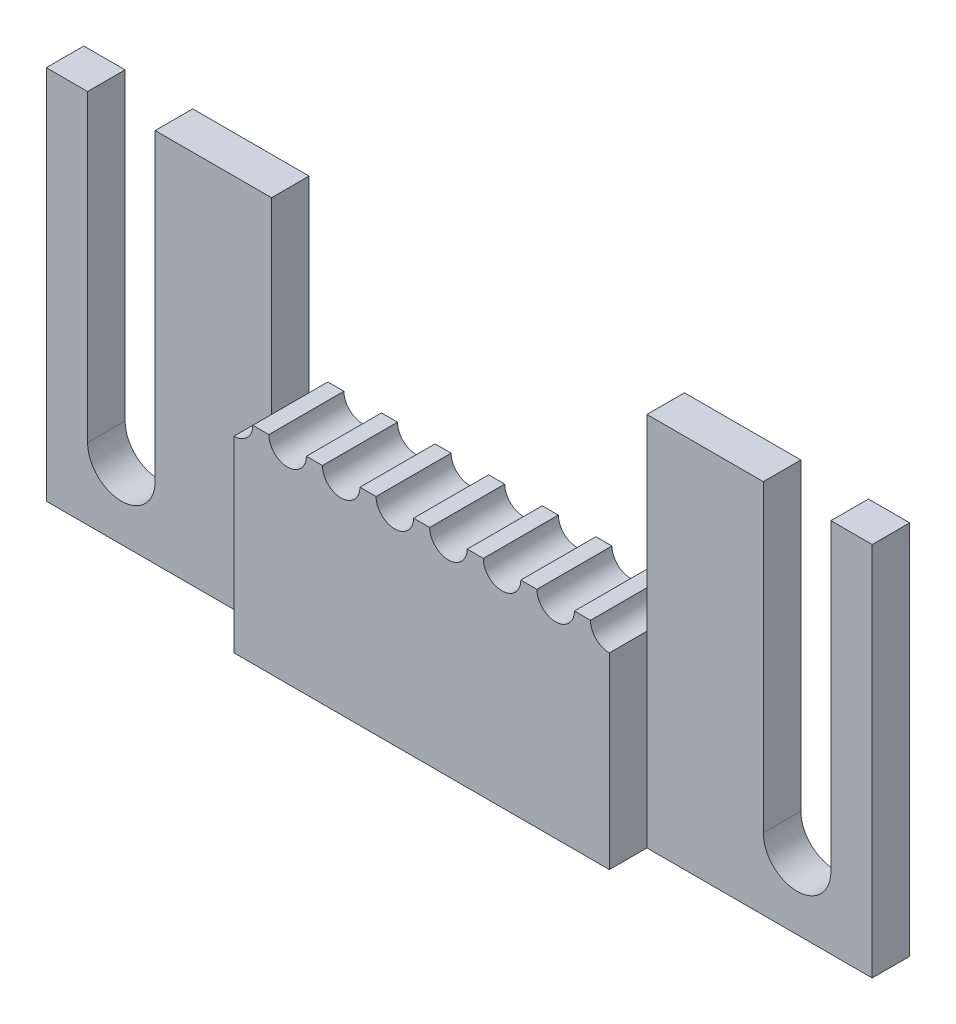
ISO-10303-21;
HEADER;
FILE_DESCRIPTION(('STEP AP214'),'2;1');
FILE_NAME('part.step','',(''),(''),'','','');
FILE_SCHEMA(('AUTOMOTIVE_DESIGN { 1 0 10303 214 1 1 1 1 }'));
ENDSEC;
DATA;
#1=APPLICATION_CONTEXT('core data for automotive mechanical design processes');
#2=APPLICATION_PROTOCOL_DEFINITION('international standard','automotive_design',2000,#1);
#3=PRODUCT_CONTEXT('',#1,'mechanical');
#4=PRODUCT('Part','Part','',(#3));
#5=PRODUCT_RELATED_PRODUCT_CATEGORY('part','',(#4));
#6=PRODUCT_DEFINITION_FORMATION('','',#4);
#7=PRODUCT_DEFINITION_CONTEXT('part definition',#1,'design');
#8=PRODUCT_DEFINITION('design','',#6,#7);
#9=PRODUCT_DEFINITION_SHAPE('','',#8);
#10=(LENGTH_UNIT() NAMED_UNIT(*) SI_UNIT(.MILLI.,.METRE.));
#11=(NAMED_UNIT(*) PLANE_ANGLE_UNIT() SI_UNIT($,.RADIAN.));
#12=(NAMED_UNIT(*) SI_UNIT($,.STERADIAN.) SOLID_ANGLE_UNIT());
#13=UNCERTAINTY_MEASURE_WITH_UNIT(LENGTH_MEASURE(1.E-05),#10,'distance_accuracy_value','');
#14=(GEOMETRIC_REPRESENTATION_CONTEXT(3) GLOBAL_UNCERTAINTY_ASSIGNED_CONTEXT((#13)) GLOBAL_UNIT_ASSIGNED_CONTEXT((#10,
#11,#12)) REPRESENTATION_CONTEXT('',''));
#15=CARTESIAN_POINT('',(0.,0.,0.));
#16=DIRECTION('',(0.,0.,1.));
#17=DIRECTION('',(1.,0.,0.));
#18=AXIS2_PLACEMENT_3D('',#15,#16,#17);
#19=CARTESIAN_POINT('',(-27.5,12.5,5.));
#20=DIRECTION('',(0.,-1.,0.));
#21=DIRECTION('',(0.,0.,-1.));
#22=AXIS2_PLACEMENT_3D('',#19,#20,#21);
#23=PLANE('',#22);
#24=DIRECTION('',(-1.,0.,0.));
#25=VECTOR('',#24,1.);
#26=CARTESIAN_POINT('',(12.5,12.5,2.5));
#27=LINE('',#26,#25);
#28=CARTESIAN_POINT('',(20.25,12.5,2.5));
#29=VERTEX_POINT('',#28);
#30=CARTESIAN_POINT('',(12.5,12.5,2.5));
#31=VERTEX_POINT('',#30);
#32=EDGE_CURVE('E621',#29,#31,#27,.T.);
#33=ORIENTED_EDGE('',*,*,#32,.F.);
#34=DIRECTION('',(0.,0.,-1.));
#35=VECTOR('',#34,1.);
#36=CARTESIAN_POINT('',(20.25,12.5,5.));
#37=LINE('',#36,#35);
#38=CARTESIAN_POINT('',(20.25,12.5,0.));
#39=VERTEX_POINT('',#38);
#40=EDGE_CURVE('E13',#29,#39,#37,.T.);
#41=ORIENTED_EDGE('',*,*,#40,.T.);
#42=DIRECTION('',(-1.,0.,0.));
#43=VECTOR('',#42,1.);
#44=CARTESIAN_POINT('',(-27.5,12.5,0.));
#45=LINE('',#44,#43);
#46=CARTESIAN_POINT('',(12.5,12.5,0.));
#47=VERTEX_POINT('',#46);
#48=EDGE_CURVE('E735',#39,#47,#45,.T.);
#49=ORIENTED_EDGE('',*,*,#48,.T.);
#50=DIRECTION('',(0.,0.,1.));
#51=VECTOR('',#50,1.);
#52=CARTESIAN_POINT('',(12.5,12.5,-5.));
#53=LINE('',#52,#51);
#54=EDGE_CURVE('E690',#47,#31,#53,.T.);
#55=ORIENTED_EDGE('',*,*,#54,.T.);
#56=EDGE_LOOP('',(#33,#41,#49,#55));
#57=FACE_BOUND('',#56,.T.);
#58=ADVANCED_FACE('F352',(#57),#23,.F.);
#59=DIRECTION('',(-1.,0.,0.));
#60=VECTOR('',#59,1.);
#61=CARTESIAN_POINT('',(-27.5,12.5,2.5));
#62=LINE('',#61,#60);
#63=CARTESIAN_POINT('',(-24.75,12.5,2.5));
#64=VERTEX_POINT('',#63);
#65=CARTESIAN_POINT('',(-27.5,12.5,2.5));
#66=VERTEX_POINT('',#65);
#67=EDGE_CURVE('E637',#64,#66,#62,.T.);
#68=ORIENTED_EDGE('',*,*,#67,.F.);
#69=DIRECTION('',(0.,0.,-1.));
#70=VECTOR('',#69,1.);
#71=CARTESIAN_POINT('',(-24.75,12.5,5.));
#72=LINE('',#71,#70);
#73=CARTESIAN_POINT('',(-24.75,12.5,0.));
#74=VERTEX_POINT('',#73);
#75=EDGE_CURVE('E803',#64,#74,#72,.T.);
#76=ORIENTED_EDGE('',*,*,#75,.T.);
#77=CARTESIAN_POINT('',(-27.5,12.5,0.));
#78=VERTEX_POINT('',#77);
#79=EDGE_CURVE('E731',#74,#78,#45,.T.);
#80=ORIENTED_EDGE('',*,*,#79,.T.);
#81=DIRECTION('',(0.,0.,-1.));
#82=VECTOR('',#81,1.);
#83=CARTESIAN_POINT('',(-27.5,12.5,5.));
#84=LINE('',#83,#82);
#85=EDGE_CURVE('E744',#66,#78,#84,.T.);
#86=ORIENTED_EDGE('',*,*,#85,.F.);
#87=EDGE_LOOP('',(#68,#76,#80,#86));
#88=FACE_BOUND('',#87,.T.);
#89=ADVANCED_FACE('F830',(#88),#23,.F.);
#90=CARTESIAN_POINT('',(27.5,12.5,0.));
#91=VERTEX_POINT('',#90);
#92=CARTESIAN_POINT('',(24.75,12.5,0.));
#93=VERTEX_POINT('',#92);
#94=EDGE_CURVE('E732',#91,#93,#45,.T.);
#95=ORIENTED_EDGE('',*,*,#94,.T.);
#96=DIRECTION('',(0.,0.,1.));
#97=VECTOR('',#96,1.);
#98=CARTESIAN_POINT('',(24.75,12.5,5.));
#99=LINE('',#98,#97);
#100=CARTESIAN_POINT('',(24.75,12.5,2.5));
#101=VERTEX_POINT('',#100);
#102=EDGE_CURVE('E360',#93,#101,#99,.T.);
#103=ORIENTED_EDGE('',*,*,#102,.T.);
#104=CARTESIAN_POINT('',(27.5,12.5,2.5));
#105=VERTEX_POINT('',#104);
#106=EDGE_CURVE('E622',#105,#101,#27,.T.);
#107=ORIENTED_EDGE('',*,*,#106,.F.);
#108=DIRECTION('',(0.,0.,-1.));
#109=VECTOR('',#108,1.);
#110=CARTESIAN_POINT('',(27.5,12.5,5.));
#111=LINE('',#110,#109);
#112=EDGE_CURVE('E747',#105,#91,#111,.T.);
#113=ORIENTED_EDGE('',*,*,#112,.T.);
#114=EDGE_LOOP('',(#95,#103,#107,#113));
#115=FACE_BOUND('',#114,.T.);
#116=ADVANCED_FACE('F807',(#115),#23,.F.);
#117=CARTESIAN_POINT('',(27.5,12.5,5.));
#118=DIRECTION('',(-1.,0.,0.));
#119=DIRECTION('',(0.,-1.,0.));
#120=AXIS2_PLACEMENT_3D('',#117,#118,#119);
#121=PLANE('',#120);
#122=DIRECTION('',(0.,1.,0.));
#123=VECTOR('',#122,1.);
#124=CARTESIAN_POINT('',(27.5,12.5,2.5));
#125=LINE('',#124,#123);
#126=CARTESIAN_POINT('',(27.5,-12.5,2.5));
#127=VERTEX_POINT('',#126);
#128=EDGE_CURVE('E619',#127,#105,#125,.T.);
#129=ORIENTED_EDGE('',*,*,#128,.F.);
#130=DIRECTION('',(0.,0.,-1.));
#131=VECTOR('',#130,1.);
#132=CARTESIAN_POINT('',(27.5,-12.5,5.));
#133=LINE('',#132,#131);
#134=CARTESIAN_POINT('',(27.5,-12.5,0.));
#135=VERTEX_POINT('',#134);
#136=EDGE_CURVE('E727',#127,#135,#133,.T.);
#137=ORIENTED_EDGE('',*,*,#136,.T.);
#138=DIRECTION('',(0.,1.,0.));
#139=VECTOR('',#138,1.);
#140=CARTESIAN_POINT('',(27.5,12.5,0.));
#141=LINE('',#140,#139);
#142=EDGE_CURVE('E676',#135,#91,#141,.T.);
#143=ORIENTED_EDGE('',*,*,#142,.T.);
#144=ORIENTED_EDGE('',*,*,#112,.F.);
#145=EDGE_LOOP('',(#129,#137,#143,#144));
#146=FACE_BOUND('',#145,.T.);
#147=ADVANCED_FACE('F354',(#146),#121,.F.);
#148=CARTESIAN_POINT('',(12.5,0.,-5.));
#149=DIRECTION('',(-1.,0.,0.));
#150=DIRECTION('',(0.,0.,1.));
#151=AXIS2_PLACEMENT_3D('',#148,#149,#150);
#152=PLANE('',#151);
#153=DIRECTION('',(0.,0.,1.));
#154=VECTOR('',#153,1.);
#155=CARTESIAN_POINT('',(12.5,4.00006400309762E-05,-5.));
#156=LINE('',#155,#154);
#157=CARTESIAN_POINT('',(12.5,4.00006400309762E-05,0.));
#158=VERTEX_POINT('',#157);
#159=CARTESIAN_POINT('',(12.5,4.00006400309762E-05,2.5));
#160=VERTEX_POINT('',#159);
#161=EDGE_CURVE('E693',#158,#160,#156,.T.);
#162=ORIENTED_EDGE('',*,*,#161,.T.);
#163=DIRECTION('',(0.,-1.,0.));
#164=VECTOR('',#163,1.);
#165=CARTESIAN_POINT('',(12.5,12.5,2.5));
#166=LINE('',#165,#164);
#167=EDGE_CURVE('E614',#31,#160,#166,.T.);
#168=ORIENTED_EDGE('',*,*,#167,.F.);
#169=ORIENTED_EDGE('',*,*,#54,.F.);
#170=DIRECTION('',(0.,-1.,0.));
#171=VECTOR('',#170,1.);
#172=CARTESIAN_POINT('',(12.5,0.,0.));
#173=LINE('',#172,#171);
#174=EDGE_CURVE('E779',#47,#158,#173,.T.);
#175=ORIENTED_EDGE('',*,*,#174,.T.);
#176=EDGE_LOOP('',(#162,#168,#169,#175));
#177=FACE_BOUND('',#176,.T.);
#178=ADVANCED_FACE('F838',(#177),#152,.T.);
#179=CARTESIAN_POINT('',(-12.5,12.5,0.));
#180=VERTEX_POINT('',#179);
#181=CARTESIAN_POINT('',(-20.25,12.5,0.));
#182=VERTEX_POINT('',#181);
#183=EDGE_CURVE('E736',#180,#182,#45,.T.);
#184=ORIENTED_EDGE('',*,*,#183,.T.);
#185=DIRECTION('',(0.,0.,1.));
#186=VECTOR('',#185,1.);
#187=CARTESIAN_POINT('',(-20.25,12.5,5.));
#188=LINE('',#187,#186);
#189=CARTESIAN_POINT('',(-20.25,12.5,2.5));
#190=VERTEX_POINT('',#189);
#191=EDGE_CURVE('E801',#182,#190,#188,.T.);
#192=ORIENTED_EDGE('',*,*,#191,.T.);
#193=CARTESIAN_POINT('',(-12.5,12.5,2.5));
#194=VERTEX_POINT('',#193);
#195=EDGE_CURVE('E638',#194,#190,#62,.T.);
#196=ORIENTED_EDGE('',*,*,#195,.F.);
#197=DIRECTION('',(0.,0.,1.));
#198=VECTOR('',#197,1.);
#199=CARTESIAN_POINT('',(-12.5,12.5,-5.));
#200=LINE('',#199,#198);
#201=EDGE_CURVE('E687',#180,#194,#200,.T.);
#202=ORIENTED_EDGE('',*,*,#201,.F.);
#203=EDGE_LOOP('',(#184,#192,#196,#202));
#204=FACE_BOUND('',#203,.T.);
#205=ADVANCED_FACE('F877',(#204),#23,.F.);
#206=CARTESIAN_POINT('',(-27.5,12.5,5.));
#207=DIRECTION('',(1.,0.,0.));
#208=DIRECTION('',(0.,0.,-1.));
#209=AXIS2_PLACEMENT_3D('',#206,#207,#208);
#210=PLANE('',#209);
#211=DIRECTION('',(0.,-1.,0.));
#212=VECTOR('',#211,1.);
#213=CARTESIAN_POINT('',(-27.5,12.5,2.5));
#214=LINE('',#213,#212);
#215=CARTESIAN_POINT('',(-27.5,-12.5,2.5));
#216=VERTEX_POINT('',#215);
#217=EDGE_CURVE('E630',#66,#216,#214,.T.);
#218=ORIENTED_EDGE('',*,*,#217,.F.);
#219=ORIENTED_EDGE('',*,*,#85,.T.);
#220=DIRECTION('',(0.,-1.,0.));
#221=VECTOR('',#220,1.);
#222=CARTESIAN_POINT('',(-27.5,12.5,0.));
#223=LINE('',#222,#221);
#224=CARTESIAN_POINT('',(-27.5,-12.5,0.));
#225=VERTEX_POINT('',#224);
#226=EDGE_CURVE('E734',#78,#225,#223,.T.);
#227=ORIENTED_EDGE('',*,*,#226,.T.);
#228=DIRECTION('',(0.,0.,-1.));
#229=VECTOR('',#228,1.);
#230=CARTESIAN_POINT('',(-27.5,-12.5,5.));
#231=LINE('',#230,#229);
#232=EDGE_CURVE('E742',#216,#225,#231,.T.);
#233=ORIENTED_EDGE('',*,*,#232,.F.);
#234=EDGE_LOOP('',(#218,#219,#227,#233));
#235=FACE_BOUND('',#234,.T.);
#236=ADVANCED_FACE('F826',(#235),#210,.F.);
#237=CARTESIAN_POINT('',(-12.5,0.,-5.));
#238=DIRECTION('',(-1.,0.,0.));
#239=DIRECTION('',(0.,0.,1.));
#240=AXIS2_PLACEMENT_3D('',#237,#238,#239);
#241=PLANE('',#240);
#242=DIRECTION('',(0.,1.,0.));
#243=VECTOR('',#242,1.);
#244=CARTESIAN_POINT('',(-12.5,0.,2.5));
#245=LINE('',#244,#243);
#246=CARTESIAN_POINT('',(-12.5,0.,2.5));
#247=VERTEX_POINT('',#246);
#248=EDGE_CURVE('E799',#247,#194,#245,.T.);
#249=ORIENTED_EDGE('',*,*,#248,.F.);
#250=DIRECTION('',(0.,0.,1.));
#251=VECTOR('',#250,1.);
#252=CARTESIAN_POINT('',(-12.5,0.,-5.));
#253=LINE('',#252,#251);
#254=CARTESIAN_POINT('',(-12.5,0.,0.));
#255=VERTEX_POINT('',#254);
#256=EDGE_CURVE('E683',#255,#247,#253,.T.);
#257=ORIENTED_EDGE('',*,*,#256,.F.);
#258=DIRECTION('',(0.,-1.,0.));
#259=VECTOR('',#258,1.);
#260=CARTESIAN_POINT('',(-12.5,0.,0.));
#261=LINE('',#260,#259);
#262=EDGE_CURVE('E796',#180,#255,#261,.T.);
#263=ORIENTED_EDGE('',*,*,#262,.F.);
#264=ORIENTED_EDGE('',*,*,#201,.T.);
#265=EDGE_LOOP('',(#249,#257,#263,#264));
#266=FACE_BOUND('',#265,.T.);
#267=ADVANCED_FACE('F888',(#266),#241,.F.);
#268=CARTESIAN_POINT('',(-27.5,-12.5,5.));
#269=DIRECTION('',(0.,1.,0.));
#270=DIRECTION('',(0.,0.,1.));
#271=AXIS2_PLACEMENT_3D('',#268,#269,#270);
#272=PLANE('',#271);
#273=DIRECTION('',(1.,0.,0.));
#274=VECTOR('',#273,1.);
#275=CARTESIAN_POINT('',(12.5,-12.5,2.5));
#276=LINE('',#275,#274);
#277=CARTESIAN_POINT('',(12.5,-12.5,2.5));
#278=VERTEX_POINT('',#277);
#279=EDGE_CURVE('E616',#278,#127,#276,.T.);
#280=ORIENTED_EDGE('',*,*,#279,.F.);
#281=DIRECTION('',(0.,0.,1.));
#282=VECTOR('',#281,1.);
#283=CARTESIAN_POINT('',(12.5,-12.5,2.5));
#284=LINE('',#283,#282);
#285=CARTESIAN_POINT('',(12.5,-12.5,5.));
#286=VERTEX_POINT('',#285);
#287=EDGE_CURVE('E625',#278,#286,#284,.T.);
#288=ORIENTED_EDGE('',*,*,#287,.T.);
#289=DIRECTION('',(1.,0.,0.));
#290=VECTOR('',#289,1.);
#291=CARTESIAN_POINT('',(-27.5,-12.5,5.));
#292=LINE('',#291,#290);
#293=CARTESIAN_POINT('',(-12.5,-12.5,5.));
#294=VERTEX_POINT('',#293);
#295=EDGE_CURVE('E724',#294,#286,#292,.T.);
#296=ORIENTED_EDGE('',*,*,#295,.F.);
#297=DIRECTION('',(0.,0.,1.));
#298=VECTOR('',#297,1.);
#299=CARTESIAN_POINT('',(-12.5,-12.5,2.5));
#300=LINE('',#299,#298);
#301=CARTESIAN_POINT('',(-12.5,-12.5,2.5));
#302=VERTEX_POINT('',#301);
#303=EDGE_CURVE('E641',#302,#294,#300,.T.);
#304=ORIENTED_EDGE('',*,*,#303,.F.);
#305=DIRECTION('',(1.,0.,0.));
#306=VECTOR('',#305,1.);
#307=CARTESIAN_POINT('',(-27.5,-12.5,2.5));
#308=LINE('',#307,#306);
#309=EDGE_CURVE('E632',#216,#302,#308,.T.);
#310=ORIENTED_EDGE('',*,*,#309,.F.);
#311=ORIENTED_EDGE('',*,*,#232,.T.);
#312=DIRECTION('',(1.,0.,0.));
#313=VECTOR('',#312,1.);
#314=CARTESIAN_POINT('',(-27.5,-12.5,0.));
#315=LINE('',#314,#313);
#316=EDGE_CURVE('E728',#225,#135,#315,.T.);
#317=ORIENTED_EDGE('',*,*,#316,.T.);
#318=ORIENTED_EDGE('',*,*,#136,.F.);
#319=EDGE_LOOP('',(#280,#288,#296,#304,#310,#311,#317,#318));
#320=FACE_BOUND('',#319,.T.);
#321=ADVANCED_FACE('F816',(#320),#272,.F.);
#322=CARTESIAN_POINT('',(0.,0.,5.));
#323=DIRECTION('',(0.,0.,1.));
#324=DIRECTION('',(1.,0.,0.));
#325=AXIS2_PLACEMENT_3D('',#322,#323,#324);
#326=PLANE('',#325);
#327=DIRECTION('',(0.,-1.,0.));
#328=VECTOR('',#327,1.);
#329=CARTESIAN_POINT('',(12.5,12.5,5.));
#330=LINE('',#329,#328);
#331=CARTESIAN_POINT('',(12.5,4.00006400309762E-05,5.));
#332=VERTEX_POINT('',#331);
#333=EDGE_CURVE('E613',#332,#286,#330,.T.);
#334=ORIENTED_EDGE('',*,*,#333,.F.);
#335=CARTESIAN_POINT('',(12.49,1.25000000000001,5.));
#336=DIRECTION('',(0.,0.,1.));
#337=DIRECTION('',(1.,0.,0.));
#338=AXIS2_PLACEMENT_3D('',#335,#336,#337);
#339=CIRCLE('',#338,1.25);
#340=CARTESIAN_POINT('',(11.24,1.25000000000001,5.));
#341=VERTEX_POINT('',#340);
#342=EDGE_CURVE('E661',#341,#332,#339,.T.);
#343=ORIENTED_EDGE('',*,*,#342,.F.);
#344=DIRECTION('',(1.,0.,0.));
#345=VECTOR('',#344,1.);
#346=CARTESIAN_POINT('',(0.,1.25000000000001,5.));
#347=LINE('',#346,#345);
#348=CARTESIAN_POINT('',(10.17,1.25000000000001,5.));
#349=VERTEX_POINT('',#348);
#350=EDGE_CURVE('E660',#349,#341,#347,.T.);
#351=ORIENTED_EDGE('',*,*,#350,.F.);
#352=CARTESIAN_POINT('',(8.92,1.25000000000001,5.));
#353=DIRECTION('',(0.,0.,1.));
#354=DIRECTION('',(1.,0.,0.));
#355=AXIS2_PLACEMENT_3D('',#352,#353,#354);
#356=CIRCLE('',#355,1.25);
#357=CARTESIAN_POINT('',(7.67,1.25000000000001,5.));
#358=VERTEX_POINT('',#357);
#359=EDGE_CURVE('E644',#358,#349,#356,.T.);
#360=ORIENTED_EDGE('',*,*,#359,.F.);
#361=CARTESIAN_POINT('',(6.6,1.25000000000001,5.));
#362=VERTEX_POINT('',#361);
#363=EDGE_CURVE('E657',#362,#358,#347,.T.);
#364=ORIENTED_EDGE('',*,*,#363,.F.);
#365=CARTESIAN_POINT('',(5.35,1.25000000000001,5.));
#366=DIRECTION('',(0.,0.,1.));
#367=DIRECTION('',(1.,0.,0.));
#368=AXIS2_PLACEMENT_3D('',#365,#366,#367);
#369=CIRCLE('',#368,1.25);
#370=CARTESIAN_POINT('',(4.1,1.25000000000001,5.));
#371=VERTEX_POINT('',#370);
#372=EDGE_CURVE('E719',#371,#362,#369,.T.);
#373=ORIENTED_EDGE('',*,*,#372,.F.);
#374=DIRECTION('',(1.,0.,0.));
#375=VECTOR('',#374,1.);
#376=CARTESIAN_POINT('',(0.,1.25000000000001,5.));
#377=LINE('',#376,#375);
#378=CARTESIAN_POINT('',(3.03,1.25000000000001,5.));
#379=VERTEX_POINT('',#378);
#380=EDGE_CURVE('E653',#379,#371,#377,.T.);
#381=ORIENTED_EDGE('',*,*,#380,.F.);
#382=CARTESIAN_POINT('',(1.78,1.25000000000001,5.));
#383=DIRECTION('',(0.,0.,1.));
#384=DIRECTION('',(1.,0.,0.));
#385=AXIS2_PLACEMENT_3D('',#382,#383,#384);
#386=CIRCLE('',#385,1.25);
#387=CARTESIAN_POINT('',(0.530000000000001,1.25000000000001,5.));
#388=VERTEX_POINT('',#387);
#389=EDGE_CURVE('E649',#388,#379,#386,.T.);
#390=ORIENTED_EDGE('',*,*,#389,.F.);
#391=CARTESIAN_POINT('',(-0.539999999999999,1.25000000000001,5.));
#392=VERTEX_POINT('',#391);
#393=EDGE_CURVE('E654',#392,#388,#377,.T.);
#394=ORIENTED_EDGE('',*,*,#393,.F.);
#395=CARTESIAN_POINT('',(-1.79,1.25000000000001,5.));
#396=DIRECTION('',(0.,0.,1.));
#397=DIRECTION('',(1.,0.,0.));
#398=AXIS2_PLACEMENT_3D('',#395,#396,#397);
#399=CIRCLE('',#398,1.25);
#400=CARTESIAN_POINT('',(-3.04,1.25000000000001,5.));
#401=VERTEX_POINT('',#400);
#402=EDGE_CURVE('E652',#401,#392,#399,.T.);
#403=ORIENTED_EDGE('',*,*,#402,.F.);
#404=CARTESIAN_POINT('',(-4.11,1.25000000000001,5.));
#405=VERTEX_POINT('',#404);
#406=EDGE_CURVE('E648',#405,#401,#377,.T.);
#407=ORIENTED_EDGE('',*,*,#406,.F.);
#408=CARTESIAN_POINT('',(-5.36,1.25000000000001,5.));
#409=DIRECTION('',(0.,0.,1.));
#410=DIRECTION('',(1.,0.,0.));
#411=AXIS2_PLACEMENT_3D('',#408,#409,#410);
#412=CIRCLE('',#411,1.25);
#413=CARTESIAN_POINT('',(-6.61,1.25000000000001,5.));
#414=VERTEX_POINT('',#413);
#415=EDGE_CURVE('E645',#414,#405,#412,.T.);
#416=ORIENTED_EDGE('',*,*,#415,.F.);
#417=DIRECTION('',(1.,0.,0.));
#418=VECTOR('',#417,1.);
#419=CARTESIAN_POINT('',(0.,1.25000000000001,5.));
#420=LINE('',#419,#418);
#421=CARTESIAN_POINT('',(-7.68,1.25000000000001,5.));
#422=VERTEX_POINT('',#421);
#423=EDGE_CURVE('E671',#422,#414,#420,.T.);
#424=ORIENTED_EDGE('',*,*,#423,.F.);
#425=CARTESIAN_POINT('',(-8.93,1.25000000000001,5.));
#426=DIRECTION('',(0.,0.,1.));
#427=DIRECTION('',(1.,0.,0.));
#428=AXIS2_PLACEMENT_3D('',#425,#426,#427);
#429=CIRCLE('',#428,1.25);
#430=CARTESIAN_POINT('',(-10.18,1.25000000000001,5.));
#431=VERTEX_POINT('',#430);
#432=EDGE_CURVE('E670',#431,#422,#429,.T.);
#433=ORIENTED_EDGE('',*,*,#432,.F.);
#434=CARTESIAN_POINT('',(-11.25,1.25000000000001,5.));
#435=VERTEX_POINT('',#434);
#436=EDGE_CURVE('E667',#435,#431,#420,.T.);
#437=ORIENTED_EDGE('',*,*,#436,.F.);
#438=CARTESIAN_POINT('',(-12.5,1.25000000000001,5.));
#439=DIRECTION('',(0.,0.,1.));
#440=DIRECTION('',(1.,0.,0.));
#441=AXIS2_PLACEMENT_3D('',#438,#439,#440);
#442=CIRCLE('',#441,1.25);
#443=CARTESIAN_POINT('',(-12.5,0.,5.));
#444=VERTEX_POINT('',#443);
#445=EDGE_CURVE('E664',#444,#435,#442,.T.);
#446=ORIENTED_EDGE('',*,*,#445,.F.);
#447=DIRECTION('',(0.,1.,0.));
#448=VECTOR('',#447,1.);
#449=CARTESIAN_POINT('',(-12.5,12.5,5.));
#450=LINE('',#449,#448);
#451=EDGE_CURVE('E629',#294,#444,#450,.T.);
#452=ORIENTED_EDGE('',*,*,#451,.F.);
#453=ORIENTED_EDGE('',*,*,#295,.T.);
#454=EDGE_LOOP('',(#334,#343,#351,#360,#364,#373,#381,#390,#394,#403,#407,#416,#424,#433,#437,
#446,#452,#453));
#455=FACE_BOUND('',#454,.T.);
#456=ADVANCED_FACE('F853',(#455),#326,.T.);
#457=CARTESIAN_POINT('',(0.,0.,0.));
#458=DIRECTION('',(0.,0.,1.));
#459=DIRECTION('',(1.,0.,0.));
#460=AXIS2_PLACEMENT_3D('',#457,#458,#459);
#461=PLANE('',#460);
#462=CARTESIAN_POINT('',(22.5,-7.75,0.));
#463=DIRECTION('',(0.,0.,1.));
#464=DIRECTION('',(1.,0.,0.));
#465=AXIS2_PLACEMENT_3D('',#462,#463,#464);
#466=CIRCLE('',#465,2.24999999999999);
#467=CARTESIAN_POINT('',(20.25,-7.75,0.));
#468=VERTEX_POINT('',#467);
#469=CARTESIAN_POINT('',(24.75,-7.75,0.));
#470=VERTEX_POINT('',#469);
#471=EDGE_CURVE('E581',#468,#470,#466,.T.);
#472=ORIENTED_EDGE('',*,*,#471,.T.);
#473=DIRECTION('',(0.,1.,0.));
#474=VECTOR('',#473,1.);
#475=CARTESIAN_POINT('',(24.75,-7.75,0.));
#476=LINE('',#475,#474);
#477=EDGE_CURVE('E567',#470,#93,#476,.T.);
#478=ORIENTED_EDGE('',*,*,#477,.T.);
#479=ORIENTED_EDGE('',*,*,#94,.F.);
#480=ORIENTED_EDGE('',*,*,#142,.F.);
#481=ORIENTED_EDGE('',*,*,#316,.F.);
#482=ORIENTED_EDGE('',*,*,#226,.F.);
#483=ORIENTED_EDGE('',*,*,#79,.F.);
#484=DIRECTION('',(0.,1.,0.));
#485=VECTOR('',#484,1.);
#486=CARTESIAN_POINT('',(-24.75,-7.75,0.));
#487=LINE('',#486,#485);
#488=CARTESIAN_POINT('',(-24.75,-7.75,0.));
#489=VERTEX_POINT('',#488);
#490=EDGE_CURVE('E598',#489,#74,#487,.T.);
#491=ORIENTED_EDGE('',*,*,#490,.F.);
#492=CARTESIAN_POINT('',(-22.5,-7.75,0.));
#493=DIRECTION('',(0.,0.,1.));
#494=DIRECTION('',(1.,0.,0.));
#495=AXIS2_PLACEMENT_3D('',#492,#493,#494);
#496=CIRCLE('',#495,2.24999999999999);
#497=CARTESIAN_POINT('',(-20.25,-7.75,0.));
#498=VERTEX_POINT('',#497);
#499=EDGE_CURVE('E608',#489,#498,#496,.T.);
#500=ORIENTED_EDGE('',*,*,#499,.T.);
#501=DIRECTION('',(0.,1.,0.));
#502=VECTOR('',#501,1.);
#503=CARTESIAN_POINT('',(-20.25,-7.75,0.));
#504=LINE('',#503,#502);
#505=EDGE_CURVE('E595',#498,#182,#504,.T.);
#506=ORIENTED_EDGE('',*,*,#505,.T.);
#507=ORIENTED_EDGE('',*,*,#183,.F.);
#508=ORIENTED_EDGE('',*,*,#262,.T.);
#509=CARTESIAN_POINT('',(-12.5,1.25000000000001,0.));
#510=DIRECTION('',(0.,0.,1.));
#511=DIRECTION('',(1.,0.,0.));
#512=AXIS2_PLACEMENT_3D('',#509,#510,#511);
#513=CIRCLE('',#512,1.25);
#514=CARTESIAN_POINT('',(-11.25,1.25000000000001,0.));
#515=VERTEX_POINT('',#514);
#516=EDGE_CURVE('E793',#255,#515,#513,.T.);
#517=ORIENTED_EDGE('',*,*,#516,.T.);
#518=DIRECTION('',(1.,0.,0.));
#519=VECTOR('',#518,1.);
#520=CARTESIAN_POINT('',(0.,1.25000000000001,0.));
#521=LINE('',#520,#519);
#522=CARTESIAN_POINT('',(-10.18,1.25000000000001,0.));
#523=VERTEX_POINT('',#522);
#524=EDGE_CURVE('E790',#515,#523,#521,.T.);
#525=ORIENTED_EDGE('',*,*,#524,.T.);
#526=CARTESIAN_POINT('',(-8.93,1.25000000000001,0.));
#527=DIRECTION('',(0.,0.,1.));
#528=DIRECTION('',(1.,0.,0.));
#529=AXIS2_PLACEMENT_3D('',#526,#527,#528);
#530=CIRCLE('',#529,1.25);
#531=CARTESIAN_POINT('',(-7.68,1.25000000000001,0.));
#532=VERTEX_POINT('',#531);
#533=EDGE_CURVE('E787',#523,#532,#530,.T.);
#534=ORIENTED_EDGE('',*,*,#533,.T.);
#535=DIRECTION('',(1.,0.,0.));
#536=VECTOR('',#535,1.);
#537=CARTESIAN_POINT('',(0.,1.25000000000001,0.));
#538=LINE('',#537,#536);
#539=CARTESIAN_POINT('',(-6.61,1.25000000000001,0.));
#540=VERTEX_POINT('',#539);
#541=EDGE_CURVE('E784',#532,#540,#538,.T.);
#542=ORIENTED_EDGE('',*,*,#541,.T.);
#543=CARTESIAN_POINT('',(-5.36,1.25000000000001,0.));
#544=DIRECTION('',(0.,0.,1.));
#545=DIRECTION('',(1.,0.,0.));
#546=AXIS2_PLACEMENT_3D('',#543,#544,#545);
#547=CIRCLE('',#546,1.25);
#548=CARTESIAN_POINT('',(-4.11,1.25000000000001,0.));
#549=VERTEX_POINT('',#548);
#550=EDGE_CURVE('E781',#540,#549,#547,.T.);
#551=ORIENTED_EDGE('',*,*,#550,.T.);
#552=DIRECTION('',(1.,0.,0.));
#553=VECTOR('',#552,1.);
#554=CARTESIAN_POINT('',(0.,1.25000000000001,0.));
#555=LINE('',#554,#553);
#556=CARTESIAN_POINT('',(-3.04,1.25000000000001,0.));
#557=VERTEX_POINT('',#556);
#558=EDGE_CURVE('E770',#549,#557,#555,.T.);
#559=ORIENTED_EDGE('',*,*,#558,.T.);
#560=CARTESIAN_POINT('',(-1.79,1.25000000000001,0.));
#561=DIRECTION('',(0.,0.,1.));
#562=DIRECTION('',(1.,0.,0.));
#563=AXIS2_PLACEMENT_3D('',#560,#561,#562);
#564=CIRCLE('',#563,1.25);
#565=CARTESIAN_POINT('',(-0.539999999999999,1.25000000000001,0.));
#566=VERTEX_POINT('',#565);
#567=EDGE_CURVE('E761',#557,#566,#564,.T.);
#568=ORIENTED_EDGE('',*,*,#567,.T.);
#569=DIRECTION('',(1.,0.,0.));
#570=VECTOR('',#569,1.);
#571=CARTESIAN_POINT('',(0.,1.25000000000001,0.));
#572=LINE('',#571,#570);
#573=CARTESIAN_POINT('',(0.530000000000001,1.25000000000001,0.));
#574=VERTEX_POINT('',#573);
#575=EDGE_CURVE('E752',#566,#574,#572,.T.);
#576=ORIENTED_EDGE('',*,*,#575,.T.);
#577=CARTESIAN_POINT('',(1.78,1.25000000000001,0.));
#578=DIRECTION('',(0.,0.,1.));
#579=DIRECTION('',(1.,0.,0.));
#580=AXIS2_PLACEMENT_3D('',#577,#578,#579);
#581=CIRCLE('',#580,1.25);
#582=CARTESIAN_POINT('',(3.03,1.25000000000001,0.));
#583=VERTEX_POINT('',#582);
#584=EDGE_CURVE('E749',#574,#583,#581,.T.);
#585=ORIENTED_EDGE('',*,*,#584,.T.);
#586=DIRECTION('',(1.,0.,0.));
#587=VECTOR('',#586,1.);
#588=CARTESIAN_POINT('',(0.,1.25000000000001,0.));
#589=LINE('',#588,#587);
#590=CARTESIAN_POINT('',(4.1,1.25000000000001,0.));
#591=VERTEX_POINT('',#590);
#592=EDGE_CURVE('E755',#583,#591,#589,.T.);
#593=ORIENTED_EDGE('',*,*,#592,.T.);
#594=CARTESIAN_POINT('',(5.35,1.25000000000001,0.));
#595=DIRECTION('',(0.,0.,1.));
#596=DIRECTION('',(1.,0.,0.));
#597=AXIS2_PLACEMENT_3D('',#594,#595,#596);
#598=CIRCLE('',#597,1.25);
#599=CARTESIAN_POINT('',(6.6,1.25000000000001,0.));
#600=VERTEX_POINT('',#599);
#601=EDGE_CURVE('E758',#591,#600,#598,.T.);
#602=ORIENTED_EDGE('',*,*,#601,.T.);
#603=DIRECTION('',(1.,0.,0.));
#604=VECTOR('',#603,1.);
#605=CARTESIAN_POINT('',(0.,1.25000000000001,0.));
#606=LINE('',#605,#604);
#607=CARTESIAN_POINT('',(7.67,1.25000000000001,0.));
#608=VERTEX_POINT('',#607);
#609=EDGE_CURVE('E764',#600,#608,#606,.T.);
#610=ORIENTED_EDGE('',*,*,#609,.T.);
#611=CARTESIAN_POINT('',(8.92,1.25000000000001,0.));
#612=DIRECTION('',(0.,0.,1.));
#613=DIRECTION('',(1.,0.,0.));
#614=AXIS2_PLACEMENT_3D('',#611,#612,#613);
#615=CIRCLE('',#614,1.25);
#616=CARTESIAN_POINT('',(10.17,1.25000000000001,0.));
#617=VERTEX_POINT('',#616);
#618=EDGE_CURVE('E767',#608,#617,#615,.T.);
#619=ORIENTED_EDGE('',*,*,#618,.T.);
#620=DIRECTION('',(1.,0.,0.));
#621=VECTOR('',#620,1.);
#622=CARTESIAN_POINT('',(0.,1.25000000000001,0.));
#623=LINE('',#622,#621);
#624=CARTESIAN_POINT('',(11.24,1.25000000000001,0.));
#625=VERTEX_POINT('',#624);
#626=EDGE_CURVE('E773',#617,#625,#623,.T.);
#627=ORIENTED_EDGE('',*,*,#626,.T.);
#628=CARTESIAN_POINT('',(12.49,1.25000000000001,0.));
#629=DIRECTION('',(0.,0.,1.));
#630=DIRECTION('',(1.,0.,0.));
#631=AXIS2_PLACEMENT_3D('',#628,#629,#630);
#632=CIRCLE('',#631,1.25);
#633=EDGE_CURVE('E776',#625,#158,#632,.T.);
#634=ORIENTED_EDGE('',*,*,#633,.T.);
#635=ORIENTED_EDGE('',*,*,#174,.F.);
#636=ORIENTED_EDGE('',*,*,#48,.F.);
#637=DIRECTION('',(0.,1.,0.));
#638=VECTOR('',#637,1.);
#639=CARTESIAN_POINT('',(20.25,-7.75,0.));
#640=LINE('',#639,#638);
#641=EDGE_CURVE('E575',#468,#39,#640,.T.);
#642=ORIENTED_EDGE('',*,*,#641,.F.);
#643=EDGE_LOOP('',(#472,#478,#479,#480,#481,#482,#483,#491,#500,#506,#507,#508,#517,#525,#534,
#542,#551,#559,#568,#576,#585,#593,#602,#610,#619,#627,#634,#635,#636,#642));
#644=FACE_BOUND('',#643,.T.);
#645=ADVANCED_FACE('F587',(#644),#461,.F.);
#646=CARTESIAN_POINT('',(0.,1.25000000000001,-5.));
#647=DIRECTION('',(0.,-1.,0.));
#648=DIRECTION('',(0.,0.,-1.));
#649=AXIS2_PLACEMENT_3D('',#646,#647,#648);
#650=PLANE('',#649);
#651=DIRECTION('',(0.,0.,1.));
#652=VECTOR('',#651,1.);
#653=CARTESIAN_POINT('',(-7.68,1.25000000000001,-5.));
#654=LINE('',#653,#652);
#655=EDGE_CURVE('E677',#532,#422,#654,.T.);
#656=ORIENTED_EDGE('',*,*,#655,.T.);
#657=ORIENTED_EDGE('',*,*,#423,.T.);
#658=DIRECTION('',(0.,0.,1.));
#659=VECTOR('',#658,1.);
#660=CARTESIAN_POINT('',(-6.61,1.25000000000001,-5.));
#661=LINE('',#660,#659);
#662=EDGE_CURVE('E674',#540,#414,#661,.T.);
#663=ORIENTED_EDGE('',*,*,#662,.F.);
#664=ORIENTED_EDGE('',*,*,#541,.F.);
#665=EDGE_LOOP('',(#656,#657,#663,#664));
#666=FACE_BOUND('',#665,.T.);
#667=ADVANCED_FACE('F1009',(#666),#650,.F.);
#668=CARTESIAN_POINT('',(-8.93,1.25000000000001,-5.));
#669=DIRECTION('',(0.,0.,1.));
#670=DIRECTION('',(1.,0.,0.));
#671=AXIS2_PLACEMENT_3D('',#668,#669,#670);
#672=CYLINDRICAL_SURFACE('',#671,1.25);
#673=DIRECTION('',(0.,0.,1.));
#674=VECTOR('',#673,1.);
#675=CARTESIAN_POINT('',(-10.18,1.25000000000001,-5.));
#676=LINE('',#675,#674);
#677=EDGE_CURVE('E679',#523,#431,#676,.T.);
#678=ORIENTED_EDGE('',*,*,#677,.T.);
#679=ORIENTED_EDGE('',*,*,#432,.T.);
#680=ORIENTED_EDGE('',*,*,#655,.F.);
#681=ORIENTED_EDGE('',*,*,#533,.F.);
#682=EDGE_LOOP('',(#678,#679,#680,#681));
#683=FACE_BOUND('',#682,.T.);
#684=ADVANCED_FACE('F1070',(#683),#672,.F.);
#685=DIRECTION('',(0.,0.,1.));
#686=VECTOR('',#685,1.);
#687=CARTESIAN_POINT('',(-11.25,1.25000000000001,-5.));
#688=LINE('',#687,#686);
#689=EDGE_CURVE('E681',#515,#435,#688,.T.);
#690=ORIENTED_EDGE('',*,*,#689,.T.);
#691=ORIENTED_EDGE('',*,*,#436,.T.);
#692=ORIENTED_EDGE('',*,*,#677,.F.);
#693=ORIENTED_EDGE('',*,*,#524,.F.);
#694=EDGE_LOOP('',(#690,#691,#692,#693));
#695=FACE_BOUND('',#694,.T.);
#696=ADVANCED_FACE('F946',(#695),#650,.F.);
#697=CARTESIAN_POINT('',(-12.5,1.25000000000001,-5.));
#698=DIRECTION('',(0.,0.,1.));
#699=DIRECTION('',(1.,0.,0.));
#700=AXIS2_PLACEMENT_3D('',#697,#698,#699);
#701=CYLINDRICAL_SURFACE('',#700,1.25);
#702=ORIENTED_EDGE('',*,*,#256,.T.);
#703=EDGE_CURVE('E686',#247,#444,#253,.T.);
#704=ORIENTED_EDGE('',*,*,#703,.T.);
#705=ORIENTED_EDGE('',*,*,#445,.T.);
#706=ORIENTED_EDGE('',*,*,#689,.F.);
#707=ORIENTED_EDGE('',*,*,#516,.F.);
#708=EDGE_LOOP('',(#702,#704,#705,#706,#707));
#709=FACE_BOUND('',#708,.T.);
#710=ADVANCED_FACE('F941',(#709),#701,.F.);
#711=CARTESIAN_POINT('',(12.49,1.25000000000001,-5.));
#712=DIRECTION('',(0.,0.,1.));
#713=DIRECTION('',(1.,0.,0.));
#714=AXIS2_PLACEMENT_3D('',#711,#712,#713);
#715=CYLINDRICAL_SURFACE('',#714,1.25);
#716=DIRECTION('',(0.,0.,1.));
#717=VECTOR('',#716,1.);
#718=CARTESIAN_POINT('',(11.24,1.25000000000001,-5.));
#719=LINE('',#718,#717);
#720=EDGE_CURVE('E697',#625,#341,#719,.T.);
#721=ORIENTED_EDGE('',*,*,#720,.T.);
#722=ORIENTED_EDGE('',*,*,#342,.T.);
#723=EDGE_CURVE('E696',#160,#332,#156,.T.);
#724=ORIENTED_EDGE('',*,*,#723,.F.);
#725=ORIENTED_EDGE('',*,*,#161,.F.);
#726=ORIENTED_EDGE('',*,*,#633,.F.);
#727=EDGE_LOOP('',(#721,#722,#724,#725,#726));
#728=FACE_BOUND('',#727,.T.);
#729=ADVANCED_FACE('F842',(#728),#715,.F.);
#730=CARTESIAN_POINT('',(0.,1.25000000000001,-5.));
#731=DIRECTION('',(0.,-1.,0.));
#732=DIRECTION('',(0.,0.,-1.));
#733=AXIS2_PLACEMENT_3D('',#730,#731,#732);
#734=PLANE('',#733);
#735=DIRECTION('',(0.,0.,1.));
#736=VECTOR('',#735,1.);
#737=CARTESIAN_POINT('',(10.17,1.25000000000001,-5.));
#738=LINE('',#737,#736);
#739=EDGE_CURVE('E699',#617,#349,#738,.T.);
#740=ORIENTED_EDGE('',*,*,#739,.T.);
#741=ORIENTED_EDGE('',*,*,#350,.T.);
#742=ORIENTED_EDGE('',*,*,#720,.F.);
#743=ORIENTED_EDGE('',*,*,#626,.F.);
#744=EDGE_LOOP('',(#740,#741,#742,#743));
#745=FACE_BOUND('',#744,.T.);
#746=ADVANCED_FACE('F846',(#745),#734,.F.);
#747=DIRECTION('',(0.,0.,1.));
#748=VECTOR('',#747,1.);
#749=CARTESIAN_POINT('',(6.6,1.25000000000001,-5.));
#750=LINE('',#749,#748);
#751=EDGE_CURVE('E703',#600,#362,#750,.T.);
#752=ORIENTED_EDGE('',*,*,#751,.T.);
#753=ORIENTED_EDGE('',*,*,#363,.T.);
#754=DIRECTION('',(0.,0.,1.));
#755=VECTOR('',#754,1.);
#756=CARTESIAN_POINT('',(7.67,1.25000000000001,-5.));
#757=LINE('',#756,#755);
#758=EDGE_CURVE('E701',#608,#358,#757,.T.);
#759=ORIENTED_EDGE('',*,*,#758,.F.);
#760=ORIENTED_EDGE('',*,*,#609,.F.);
#761=EDGE_LOOP('',(#752,#753,#759,#760));
#762=FACE_BOUND('',#761,.T.);
#763=ADVANCED_FACE('F1076',(#762),#734,.F.);
#764=CARTESIAN_POINT('',(0.,1.25000000000001,-5.));
#765=DIRECTION('',(0.,-1.,0.));
#766=DIRECTION('',(0.,0.,-1.));
#767=AXIS2_PLACEMENT_3D('',#764,#765,#766);
#768=PLANE('',#767);
#769=DIRECTION('',(0.,0.,1.));
#770=VECTOR('',#769,1.);
#771=CARTESIAN_POINT('',(3.03,1.25000000000001,-5.));
#772=LINE('',#771,#770);
#773=EDGE_CURVE('E707',#583,#379,#772,.T.);
#774=ORIENTED_EDGE('',*,*,#773,.T.);
#775=ORIENTED_EDGE('',*,*,#380,.T.);
#776=DIRECTION('',(0.,0.,1.));
#777=VECTOR('',#776,1.);
#778=CARTESIAN_POINT('',(4.1,1.25000000000001,-5.));
#779=LINE('',#778,#777);
#780=EDGE_CURVE('E705',#591,#371,#779,.T.);
#781=ORIENTED_EDGE('',*,*,#780,.F.);
#782=ORIENTED_EDGE('',*,*,#592,.F.);
#783=EDGE_LOOP('',(#774,#775,#781,#782));
#784=FACE_BOUND('',#783,.T.);
#785=ADVANCED_FACE('F1077',(#784),#768,.F.);
#786=DIRECTION('',(0.,0.,1.));
#787=VECTOR('',#786,1.);
#788=CARTESIAN_POINT('',(-0.539999999999999,1.25000000000001,-5.));
#789=LINE('',#788,#787);
#790=EDGE_CURVE('E711',#566,#392,#789,.T.);
#791=ORIENTED_EDGE('',*,*,#790,.T.);
#792=ORIENTED_EDGE('',*,*,#393,.T.);
#793=DIRECTION('',(0.,0.,1.));
#794=VECTOR('',#793,1.);
#795=CARTESIAN_POINT('',(0.530000000000001,1.25000000000001,-5.));
#796=LINE('',#795,#794);
#797=EDGE_CURVE('E709',#574,#388,#796,.T.);
#798=ORIENTED_EDGE('',*,*,#797,.F.);
#799=ORIENTED_EDGE('',*,*,#575,.F.);
#800=EDGE_LOOP('',(#791,#792,#798,#799));
#801=FACE_BOUND('',#800,.T.);
#802=ADVANCED_FACE('F1080',(#801),#768,.F.);
#803=CARTESIAN_POINT('',(-1.79,1.25000000000001,-5.));
#804=DIRECTION('',(0.,0.,1.));
#805=DIRECTION('',(1.,0.,0.));
#806=AXIS2_PLACEMENT_3D('',#803,#804,#805);
#807=CYLINDRICAL_SURFACE('',#806,1.25);
#808=DIRECTION('',(0.,0.,1.));
#809=VECTOR('',#808,1.);
#810=CARTESIAN_POINT('',(-3.04,1.25000000000001,-5.));
#811=LINE('',#810,#809);
#812=EDGE_CURVE('E713',#557,#401,#811,.T.);
#813=ORIENTED_EDGE('',*,*,#812,.T.);
#814=ORIENTED_EDGE('',*,*,#402,.T.);
#815=ORIENTED_EDGE('',*,*,#790,.F.);
#816=ORIENTED_EDGE('',*,*,#567,.F.);
#817=EDGE_LOOP('',(#813,#814,#815,#816));
#818=FACE_BOUND('',#817,.T.);
#819=ADVANCED_FACE('F1083',(#818),#807,.F.);
#820=DIRECTION('',(0.,0.,1.));
#821=VECTOR('',#820,1.);
#822=CARTESIAN_POINT('',(-4.11,1.25000000000001,-5.));
#823=LINE('',#822,#821);
#824=EDGE_CURVE('E715',#549,#405,#823,.T.);
#825=ORIENTED_EDGE('',*,*,#824,.T.);
#826=ORIENTED_EDGE('',*,*,#406,.T.);
#827=ORIENTED_EDGE('',*,*,#812,.F.);
#828=ORIENTED_EDGE('',*,*,#558,.F.);
#829=EDGE_LOOP('',(#825,#826,#827,#828));
#830=FACE_BOUND('',#829,.T.);
#831=ADVANCED_FACE('F1082',(#830),#768,.F.);
#832=CARTESIAN_POINT('',(-5.36,1.25000000000001,-5.));
#833=DIRECTION('',(0.,0.,1.));
#834=DIRECTION('',(1.,0.,0.));
#835=AXIS2_PLACEMENT_3D('',#832,#833,#834);
#836=CYLINDRICAL_SURFACE('',#835,1.25);
#837=ORIENTED_EDGE('',*,*,#662,.T.);
#838=ORIENTED_EDGE('',*,*,#415,.T.);
#839=ORIENTED_EDGE('',*,*,#824,.F.);
#840=ORIENTED_EDGE('',*,*,#550,.F.);
#841=EDGE_LOOP('',(#837,#838,#839,#840));
#842=FACE_BOUND('',#841,.T.);
#843=ADVANCED_FACE('F1087',(#842),#836,.F.);
#844=CARTESIAN_POINT('',(8.92,1.25000000000001,-5.));
#845=DIRECTION('',(0.,0.,1.));
#846=DIRECTION('',(1.,0.,0.));
#847=AXIS2_PLACEMENT_3D('',#844,#845,#846);
#848=CYLINDRICAL_SURFACE('',#847,1.25);
#849=ORIENTED_EDGE('',*,*,#758,.T.);
#850=ORIENTED_EDGE('',*,*,#359,.T.);
#851=ORIENTED_EDGE('',*,*,#739,.F.);
#852=ORIENTED_EDGE('',*,*,#618,.F.);
#853=EDGE_LOOP('',(#849,#850,#851,#852));
#854=FACE_BOUND('',#853,.T.);
#855=ADVANCED_FACE('F1090',(#854),#848,.F.);
#856=CARTESIAN_POINT('',(5.35,1.25000000000001,-5.));
#857=DIRECTION('',(0.,0.,1.));
#858=DIRECTION('',(1.,0.,0.));
#859=AXIS2_PLACEMENT_3D('',#856,#857,#858);
#860=CYLINDRICAL_SURFACE('',#859,1.25);
#861=ORIENTED_EDGE('',*,*,#780,.T.);
#862=ORIENTED_EDGE('',*,*,#372,.T.);
#863=ORIENTED_EDGE('',*,*,#751,.F.);
#864=ORIENTED_EDGE('',*,*,#601,.F.);
#865=EDGE_LOOP('',(#861,#862,#863,#864));
#866=FACE_BOUND('',#865,.T.);
#867=ADVANCED_FACE('F1093',(#866),#860,.F.);
#868=CARTESIAN_POINT('',(1.78,1.25000000000001,-5.));
#869=DIRECTION('',(0.,0.,1.));
#870=DIRECTION('',(1.,0.,0.));
#871=AXIS2_PLACEMENT_3D('',#868,#869,#870);
#872=CYLINDRICAL_SURFACE('',#871,1.25);
#873=ORIENTED_EDGE('',*,*,#797,.T.);
#874=ORIENTED_EDGE('',*,*,#389,.T.);
#875=ORIENTED_EDGE('',*,*,#773,.F.);
#876=ORIENTED_EDGE('',*,*,#584,.F.);
#877=EDGE_LOOP('',(#873,#874,#875,#876));
#878=FACE_BOUND('',#877,.T.);
#879=ADVANCED_FACE('F970',(#878),#872,.F.);
#880=CARTESIAN_POINT('',(-12.5,12.5,2.5));
#881=DIRECTION('',(1.,0.,0.));
#882=DIRECTION('',(0.,0.,-1.));
#883=AXIS2_PLACEMENT_3D('',#880,#881,#882);
#884=PLANE('',#883);
#885=DIRECTION('',(0.,1.,0.));
#886=VECTOR('',#885,1.);
#887=CARTESIAN_POINT('',(-12.5,12.5,2.5));
#888=LINE('',#887,#886);
#889=EDGE_CURVE('E635',#302,#247,#888,.T.);
#890=ORIENTED_EDGE('',*,*,#889,.F.);
#891=ORIENTED_EDGE('',*,*,#303,.T.);
#892=ORIENTED_EDGE('',*,*,#451,.T.);
#893=ORIENTED_EDGE('',*,*,#703,.F.);
#894=EDGE_LOOP('',(#890,#891,#892,#893));
#895=FACE_BOUND('',#894,.T.);
#896=ADVANCED_FACE('F964',(#895),#884,.F.);
#897=CARTESIAN_POINT('',(0.,0.,2.5));
#898=DIRECTION('',(0.,0.,1.));
#899=DIRECTION('',(1.,0.,0.));
#900=AXIS2_PLACEMENT_3D('',#897,#898,#899);
#901=PLANE('',#900);
#902=DIRECTION('',(0.,1.,0.));
#903=VECTOR('',#902,1.);
#904=CARTESIAN_POINT('',(-20.2500000000001,-7.75,2.5));
#905=LINE('',#904,#903);
#906=CARTESIAN_POINT('',(-20.25,-7.75,2.5));
#907=VERTEX_POINT('',#906);
#908=EDGE_CURVE('E375',#907,#190,#905,.T.);
#909=ORIENTED_EDGE('',*,*,#908,.F.);
#910=CARTESIAN_POINT('',(-22.5,-7.75,2.5));
#911=DIRECTION('',(0.,0.,1.));
#912=DIRECTION('',(1.,0.,0.));
#913=AXIS2_PLACEMENT_3D('',#910,#911,#912);
#914=CIRCLE('',#913,2.24999999999999);
#915=CARTESIAN_POINT('',(-24.75,-7.75,2.5));
#916=VERTEX_POINT('',#915);
#917=EDGE_CURVE('E606',#916,#907,#914,.T.);
#918=ORIENTED_EDGE('',*,*,#917,.F.);
#919=DIRECTION('',(0.,1.,0.));
#920=VECTOR('',#919,1.);
#921=CARTESIAN_POINT('',(-24.75,-7.75,2.5));
#922=LINE('',#921,#920);
#923=EDGE_CURVE('E600',#916,#64,#922,.T.);
#924=ORIENTED_EDGE('',*,*,#923,.T.);
#925=ORIENTED_EDGE('',*,*,#67,.T.);
#926=ORIENTED_EDGE('',*,*,#217,.T.);
#927=ORIENTED_EDGE('',*,*,#309,.T.);
#928=ORIENTED_EDGE('',*,*,#889,.T.);
#929=ORIENTED_EDGE('',*,*,#248,.T.);
#930=ORIENTED_EDGE('',*,*,#195,.T.);
#931=EDGE_LOOP('',(#909,#918,#924,#925,#926,#927,#928,#929,#930));
#932=FACE_BOUND('',#931,.T.);
#933=ADVANCED_FACE('F969',(#932),#901,.T.);
#934=CARTESIAN_POINT('',(12.5,12.5,2.5));
#935=DIRECTION('',(-1.,0.,0.));
#936=DIRECTION('',(0.,0.,1.));
#937=AXIS2_PLACEMENT_3D('',#934,#935,#936);
#938=PLANE('',#937);
#939=ORIENTED_EDGE('',*,*,#333,.T.);
#940=ORIENTED_EDGE('',*,*,#287,.F.);
#941=EDGE_CURVE('E617',#160,#278,#166,.T.);
#942=ORIENTED_EDGE('',*,*,#941,.F.);
#943=ORIENTED_EDGE('',*,*,#723,.T.);
#944=EDGE_LOOP('',(#939,#940,#942,#943));
#945=FACE_BOUND('',#944,.T.);
#946=ADVANCED_FACE('F856',(#945),#938,.F.);
#947=CARTESIAN_POINT('',(0.,0.,2.5));
#948=DIRECTION('',(0.,0.,1.));
#949=DIRECTION('',(1.,0.,0.));
#950=AXIS2_PLACEMENT_3D('',#947,#948,#949);
#951=PLANE('',#950);
#952=DIRECTION('',(0.,1.,0.));
#953=VECTOR('',#952,1.);
#954=CARTESIAN_POINT('',(24.75,-7.75,2.5));
#955=LINE('',#954,#953);
#956=CARTESIAN_POINT('',(24.75,-7.75,2.5));
#957=VERTEX_POINT('',#956);
#958=EDGE_CURVE('E367',#957,#101,#955,.T.);
#959=ORIENTED_EDGE('',*,*,#958,.F.);
#960=CARTESIAN_POINT('',(22.5,-7.75,2.5));
#961=DIRECTION('',(0.,0.,1.));
#962=DIRECTION('',(1.,0.,0.));
#963=AXIS2_PLACEMENT_3D('',#960,#961,#962);
#964=CIRCLE('',#963,2.24999999999999);
#965=CARTESIAN_POINT('',(20.2500000000001,-7.75,2.5));
#966=VERTEX_POINT('',#965);
#967=EDGE_CURVE('E584',#966,#957,#964,.T.);
#968=ORIENTED_EDGE('',*,*,#967,.F.);
#969=DIRECTION('',(0.,1.,0.));
#970=VECTOR('',#969,1.);
#971=CARTESIAN_POINT('',(20.25,-7.75,2.5));
#972=LINE('',#971,#970);
#973=EDGE_CURVE('E585',#966,#29,#972,.T.);
#974=ORIENTED_EDGE('',*,*,#973,.T.);
#975=ORIENTED_EDGE('',*,*,#32,.T.);
#976=ORIENTED_EDGE('',*,*,#167,.T.);
#977=ORIENTED_EDGE('',*,*,#941,.T.);
#978=ORIENTED_EDGE('',*,*,#279,.T.);
#979=ORIENTED_EDGE('',*,*,#128,.T.);
#980=ORIENTED_EDGE('',*,*,#106,.T.);
#981=EDGE_LOOP('',(#959,#968,#974,#975,#976,#977,#978,#979,#980));
#982=FACE_BOUND('',#981,.T.);
#983=ADVANCED_FACE('F810',(#982),#951,.T.);
#984=CARTESIAN_POINT('',(-24.75,-7.75,2.5));
#985=DIRECTION('',(-1.,0.,0.));
#986=DIRECTION('',(0.,0.,1.));
#987=AXIS2_PLACEMENT_3D('',#984,#985,#986);
#988=PLANE('',#987);
#989=ORIENTED_EDGE('',*,*,#923,.F.);
#990=DIRECTION('',(0.,0.,1.));
#991=VECTOR('',#990,1.);
#992=CARTESIAN_POINT('',(-24.75,-7.75,2.5));
#993=LINE('',#992,#991);
#994=EDGE_CURVE('E611',#916,#489,#993,.F.);
#995=ORIENTED_EDGE('',*,*,#994,.T.);
#996=ORIENTED_EDGE('',*,*,#490,.T.);
#997=ORIENTED_EDGE('',*,*,#75,.F.);
#998=EDGE_LOOP('',(#989,#995,#996,#997));
#999=FACE_BOUND('',#998,.T.);
#1000=ADVANCED_FACE('F1025',(#999),#988,.F.);
#1001=CARTESIAN_POINT('',(-20.25,-7.75,0.));
#1002=DIRECTION('',(1.,0.,0.));
#1003=DIRECTION('',(0.,0.,-1.));
#1004=AXIS2_PLACEMENT_3D('',#1001,#1002,#1003);
#1005=PLANE('',#1004);
#1006=ORIENTED_EDGE('',*,*,#505,.F.);
#1007=DIRECTION('',(0.,0.,-1.));
#1008=VECTOR('',#1007,1.);
#1009=CARTESIAN_POINT('',(-20.25,-7.75,0.));
#1010=LINE('',#1009,#1008);
#1011=EDGE_CURVE('E603',#907,#498,#1010,.T.);
#1012=ORIENTED_EDGE('',*,*,#1011,.F.);
#1013=ORIENTED_EDGE('',*,*,#908,.T.);
#1014=ORIENTED_EDGE('',*,*,#191,.F.);
#1015=EDGE_LOOP('',(#1006,#1012,#1013,#1014));
#1016=FACE_BOUND('',#1015,.T.);
#1017=ADVANCED_FACE('F872',(#1016),#1005,.F.);
#1018=CARTESIAN_POINT('',(-22.5,-7.75,2.5));
#1019=DIRECTION('',(0.,0.,1.));
#1020=DIRECTION('',(1.,0.,0.));
#1021=AXIS2_PLACEMENT_3D('',#1018,#1019,#1020);
#1022=CYLINDRICAL_SURFACE('',#1021,2.24999999999999);
#1023=ORIENTED_EDGE('',*,*,#917,.T.);
#1024=ORIENTED_EDGE('',*,*,#1011,.T.);
#1025=ORIENTED_EDGE('',*,*,#499,.F.);
#1026=ORIENTED_EDGE('',*,*,#994,.F.);
#1027=EDGE_LOOP('',(#1023,#1024,#1025,#1026));
#1028=FACE_BOUND('',#1027,.T.);
#1029=ADVANCED_FACE('F865',(#1028),#1022,.F.);
#1030=CARTESIAN_POINT('',(20.25,-7.75,2.5));
#1031=DIRECTION('',(-1.,0.,0.));
#1032=DIRECTION('',(0.,0.,1.));
#1033=AXIS2_PLACEMENT_3D('',#1030,#1031,#1032);
#1034=PLANE('',#1033);
#1035=ORIENTED_EDGE('',*,*,#973,.F.);
#1036=DIRECTION('',(0.,0.,1.));
#1037=VECTOR('',#1036,1.);
#1038=CARTESIAN_POINT('',(20.25,-7.75,2.5));
#1039=LINE('',#1038,#1037);
#1040=EDGE_CURVE('E589',#966,#468,#1039,.F.);
#1041=ORIENTED_EDGE('',*,*,#1040,.T.);
#1042=ORIENTED_EDGE('',*,*,#641,.T.);
#1043=ORIENTED_EDGE('',*,*,#40,.F.);
#1044=EDGE_LOOP('',(#1035,#1041,#1042,#1043));
#1045=FACE_BOUND('',#1044,.T.);
#1046=ADVANCED_FACE('F863',(#1045),#1034,.F.);
#1047=CARTESIAN_POINT('',(24.75,-7.75,0.));
#1048=DIRECTION('',(1.,0.,0.));
#1049=DIRECTION('',(0.,0.,-1.));
#1050=AXIS2_PLACEMENT_3D('',#1047,#1048,#1049);
#1051=PLANE('',#1050);
#1052=ORIENTED_EDGE('',*,*,#477,.F.);
#1053=DIRECTION('',(0.,0.,-1.));
#1054=VECTOR('',#1053,1.);
#1055=CARTESIAN_POINT('',(24.75,-7.75,0.));
#1056=LINE('',#1055,#1054);
#1057=EDGE_CURVE('E570',#957,#470,#1056,.T.);
#1058=ORIENTED_EDGE('',*,*,#1057,.F.);
#1059=ORIENTED_EDGE('',*,*,#958,.T.);
#1060=ORIENTED_EDGE('',*,*,#102,.F.);
#1061=EDGE_LOOP('',(#1052,#1058,#1059,#1060));
#1062=FACE_BOUND('',#1061,.T.);
#1063=ADVANCED_FACE('F569',(#1062),#1051,.F.);
#1064=CARTESIAN_POINT('',(22.5,-7.75,2.5));
#1065=DIRECTION('',(0.,0.,1.));
#1066=DIRECTION('',(1.,0.,0.));
#1067=AXIS2_PLACEMENT_3D('',#1064,#1065,#1066);
#1068=CYLINDRICAL_SURFACE('',#1067,2.24999999999999);
#1069=ORIENTED_EDGE('',*,*,#967,.T.);
#1070=ORIENTED_EDGE('',*,*,#1057,.T.);
#1071=ORIENTED_EDGE('',*,*,#471,.F.);
#1072=ORIENTED_EDGE('',*,*,#1040,.F.);
#1073=EDGE_LOOP('',(#1069,#1070,#1071,#1072));
#1074=FACE_BOUND('',#1073,.T.);
#1075=ADVANCED_FACE('F579',(#1074),#1068,.F.);
#1076=CLOSED_SHELL('',(#58,#89,#116,#147,#178,#205,#236,#267,#321,#456,#645,#667,#684,#696,#710,
#729,#746,#763,#785,#802,#819,#831,#843,#855,#867,#879,#896,#933,#946,#983,#1000,#1017,#1029,
#1046,#1063,#1075));
#1077=MANIFOLD_SOLID_BREP('B2',#1076);
#1078=ADVANCED_BREP_SHAPE_REPRESENTATION('',(#18,#1077),#14);
#1079=SHAPE_DEFINITION_REPRESENTATION(#9,#1078);
ENDSEC;
END-ISO-10303-21;
